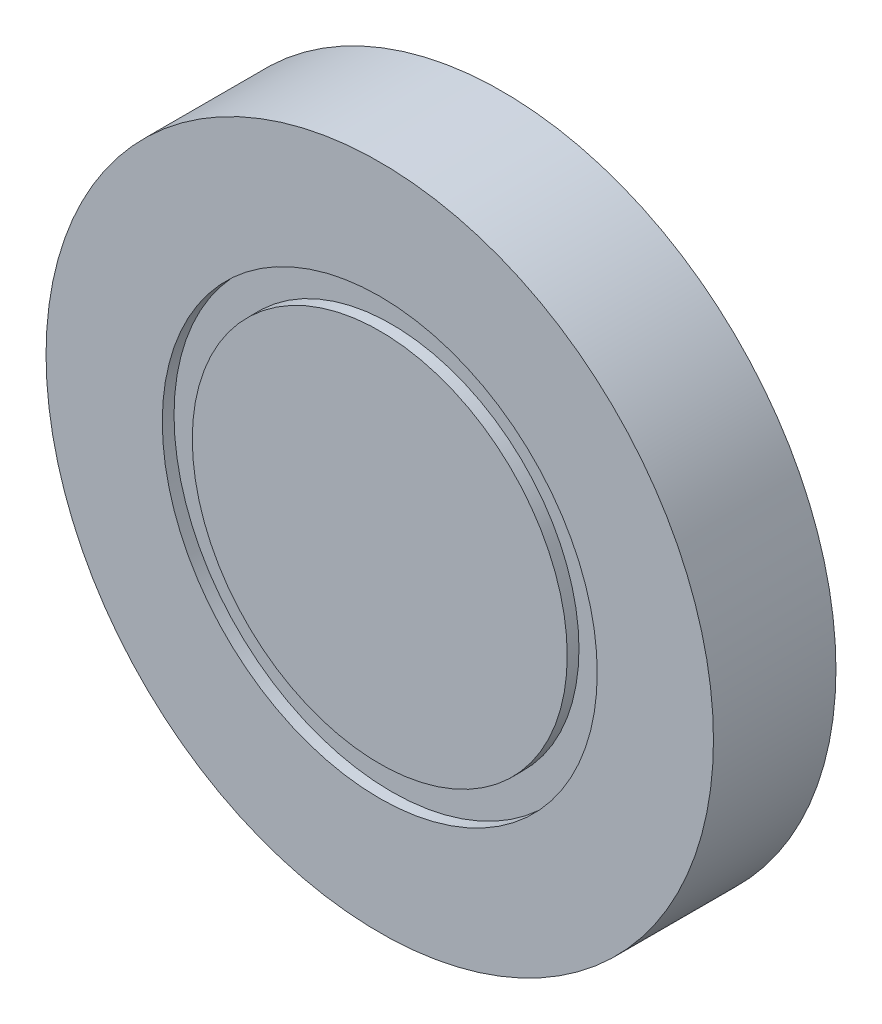
ISO-10303-21;
HEADER;
FILE_DESCRIPTION(('STEP AP214'),'2;1');
FILE_NAME('part.step','',(''),(''),'','','');
FILE_SCHEMA(('AUTOMOTIVE_DESIGN { 1 0 10303 214 1 1 1 1 }'));
ENDSEC;
DATA;
#1=APPLICATION_CONTEXT('core data for automotive mechanical design processes');
#2=APPLICATION_PROTOCOL_DEFINITION('international standard','automotive_design',2000,#1);
#3=PRODUCT_CONTEXT('',#1,'mechanical');
#4=PRODUCT('Part','Part','',(#3));
#5=PRODUCT_RELATED_PRODUCT_CATEGORY('part','',(#4));
#6=PRODUCT_DEFINITION_FORMATION('','',#4);
#7=PRODUCT_DEFINITION_CONTEXT('part definition',#1,'design');
#8=PRODUCT_DEFINITION('design','',#6,#7);
#9=PRODUCT_DEFINITION_SHAPE('','',#8);
#10=(LENGTH_UNIT() NAMED_UNIT(*) SI_UNIT(.MILLI.,.METRE.));
#11=(NAMED_UNIT(*) PLANE_ANGLE_UNIT() SI_UNIT($,.RADIAN.));
#12=(NAMED_UNIT(*) SI_UNIT($,.STERADIAN.) SOLID_ANGLE_UNIT());
#13=UNCERTAINTY_MEASURE_WITH_UNIT(LENGTH_MEASURE(1.E-05),#10,'distance_accuracy_value','');
#14=(GEOMETRIC_REPRESENTATION_CONTEXT(3) GLOBAL_UNCERTAINTY_ASSIGNED_CONTEXT((#13)) GLOBAL_UNIT_ASSIGNED_CONTEXT((#10,
#11,#12)) REPRESENTATION_CONTEXT('',''));
#15=CARTESIAN_POINT('',(0.,0.,0.));
#16=DIRECTION('',(0.,0.,1.));
#17=DIRECTION('',(1.,0.,0.));
#18=AXIS2_PLACEMENT_3D('',#15,#16,#17);
#19=CARTESIAN_POINT('',(0.,0.,49.));
#20=DIRECTION('',(0.,0.,-1.));
#21=DIRECTION('',(-1.,0.,0.));
#22=AXIS2_PLACEMENT_3D('',#19,#20,#21);
#23=CYLINDRICAL_SURFACE('',#22,75.);
#24=CARTESIAN_POINT('',(0.,0.,44.3));
#25=DIRECTION('',(0.,0.,1.));
#26=DIRECTION('',(1.,0.,0.));
#27=AXIS2_PLACEMENT_3D('',#24,#25,#26);
#28=CIRCLE('',#27,75.);
#29=CARTESIAN_POINT('',(75.,0.,44.3));
#30=VERTEX_POINT('',#29);
#31=EDGE_CURVE('E50',#30,#30,#28,.T.);
#32=ORIENTED_EDGE('',*,*,#31,.T.);
#33=EDGE_LOOP('',(#32));
#34=FACE_BOUND('',#33,.T.);
#35=CARTESIAN_POINT('',(0.,0.,49.));
#36=DIRECTION('',(0.,0.,1.));
#37=DIRECTION('',(1.,0.,0.));
#38=AXIS2_PLACEMENT_3D('',#35,#36,#37);
#39=CIRCLE('',#38,75.);
#40=CARTESIAN_POINT('',(75.,0.,49.));
#41=VERTEX_POINT('',#40);
#42=EDGE_CURVE('E11',#41,#41,#39,.T.);
#43=ORIENTED_EDGE('',*,*,#42,.F.);
#44=EDGE_LOOP('',(#43));
#45=FACE_BOUND('',#44,.T.);
#46=ADVANCED_FACE('F44',(#34,#45),#23,.T.);
#47=CARTESIAN_POINT('',(0.,0.,49.));
#48=DIRECTION('',(0.,0.,1.));
#49=DIRECTION('',(1.,0.,0.));
#50=AXIS2_PLACEMENT_3D('',#47,#48,#49);
#51=PLANE('',#50);
#52=ORIENTED_EDGE('',*,*,#42,.T.);
#53=EDGE_LOOP('',(#52));
#54=FACE_BOUND('',#53,.T.);
#55=ADVANCED_FACE('F84',(#54),#51,.T.);
#56=CARTESIAN_POINT('',(0.,0.,44.3));
#57=DIRECTION('',(0.,0.,1.));
#58=DIRECTION('',(1.,0.,0.));
#59=AXIS2_PLACEMENT_3D('',#56,#57,#58);
#60=PLANE('',#59);
#61=CARTESIAN_POINT('',(0.,0.,44.3));
#62=DIRECTION('',(0.,0.,1.));
#63=DIRECTION('',(1.,0.,0.));
#64=AXIS2_PLACEMENT_3D('',#61,#62,#63);
#65=CIRCLE('',#64,87.);
#66=CARTESIAN_POINT('',(87.,0.,44.3));
#67=VERTEX_POINT('',#66);
#68=EDGE_CURVE('E54',#67,#67,#65,.F.);
#69=ORIENTED_EDGE('',*,*,#68,.F.);
#70=EDGE_LOOP('',(#69));
#71=FACE_BOUND('',#70,.T.);
#72=ORIENTED_EDGE('',*,*,#31,.F.);
#73=EDGE_LOOP('',(#72));
#74=FACE_BOUND('',#73,.T.);
#75=ADVANCED_FACE('F75',(#71,#74),#60,.T.);
#76=CARTESIAN_POINT('',(0.,0.,49.));
#77=DIRECTION('',(0.,0.,1.));
#78=DIRECTION('',(1.,0.,0.));
#79=AXIS2_PLACEMENT_3D('',#76,#77,#78);
#80=PLANE('',#79);
#81=CARTESIAN_POINT('',(0.,0.,49.));
#82=DIRECTION('',(0.,0.,1.));
#83=DIRECTION('',(1.,0.,0.));
#84=AXIS2_PLACEMENT_3D('',#81,#82,#83);
#85=CIRCLE('',#84,133.5);
#86=CARTESIAN_POINT('',(133.5,0.,49.));
#87=VERTEX_POINT('',#86);
#88=EDGE_CURVE('E58',#87,#87,#85,.T.);
#89=ORIENTED_EDGE('',*,*,#88,.T.);
#90=EDGE_LOOP('',(#89));
#91=FACE_BOUND('',#90,.T.);
#92=CARTESIAN_POINT('',(0.,0.,49.));
#93=DIRECTION('',(0.,0.,1.));
#94=DIRECTION('',(1.,0.,0.));
#95=AXIS2_PLACEMENT_3D('',#92,#93,#94);
#96=CIRCLE('',#95,87.);
#97=CARTESIAN_POINT('',(87.,0.,49.));
#98=VERTEX_POINT('',#97);
#99=EDGE_CURVE('E64',#98,#98,#96,.T.);
#100=ORIENTED_EDGE('',*,*,#99,.F.);
#101=EDGE_LOOP('',(#100));
#102=FACE_BOUND('',#101,.T.);
#103=ADVANCED_FACE('F72',(#91,#102),#80,.T.);
#104=CARTESIAN_POINT('',(0.,0.,49.));
#105=DIRECTION('',(0.,0.,-1.));
#106=DIRECTION('',(-1.,0.,0.));
#107=AXIS2_PLACEMENT_3D('',#104,#105,#106);
#108=CYLINDRICAL_SURFACE('',#107,133.5);
#109=ORIENTED_EDGE('',*,*,#88,.F.);
#110=EDGE_LOOP('',(#109));
#111=FACE_BOUND('',#110,.T.);
#112=CARTESIAN_POINT('',(0.,0.,0.));
#113=DIRECTION('',(0.,0.,1.));
#114=DIRECTION('',(1.,0.,0.));
#115=AXIS2_PLACEMENT_3D('',#112,#113,#114);
#116=CIRCLE('',#115,133.5);
#117=CARTESIAN_POINT('',(133.5,0.,0.));
#118=VERTEX_POINT('',#117);
#119=EDGE_CURVE('E61',#118,#118,#116,.T.);
#120=ORIENTED_EDGE('',*,*,#119,.T.);
#121=EDGE_LOOP('',(#120));
#122=FACE_BOUND('',#121,.T.);
#123=ADVANCED_FACE('F74',(#111,#122),#108,.T.);
#124=CARTESIAN_POINT('',(0.,0.,49.));
#125=DIRECTION('',(0.,0.,-1.));
#126=DIRECTION('',(-1.,0.,0.));
#127=AXIS2_PLACEMENT_3D('',#124,#125,#126);
#128=CYLINDRICAL_SURFACE('',#127,87.);
#129=ORIENTED_EDGE('',*,*,#68,.T.);
#130=EDGE_LOOP('',(#129));
#131=FACE_BOUND('',#130,.T.);
#132=ORIENTED_EDGE('',*,*,#99,.T.);
#133=EDGE_LOOP('',(#132));
#134=FACE_BOUND('',#133,.T.);
#135=ADVANCED_FACE('F70',(#131,#134),#128,.F.);
#136=CARTESIAN_POINT('',(0.,0.,0.));
#137=DIRECTION('',(0.,0.,1.));
#138=DIRECTION('',(1.,0.,0.));
#139=AXIS2_PLACEMENT_3D('',#136,#137,#138);
#140=PLANE('',#139);
#141=ORIENTED_EDGE('',*,*,#119,.F.);
#142=EDGE_LOOP('',(#141));
#143=FACE_BOUND('',#142,.T.);
#144=ADVANCED_FACE('F96',(#143),#140,.F.);
#145=CLOSED_SHELL('',(#46,#55,#75,#103,#123,#135,#144));
#146=MANIFOLD_SOLID_BREP('B2',#145);
#147=ADVANCED_BREP_SHAPE_REPRESENTATION('',(#18,#146),#14);
#148=SHAPE_DEFINITION_REPRESENTATION(#9,#147);
ENDSEC;
END-ISO-10303-21;
